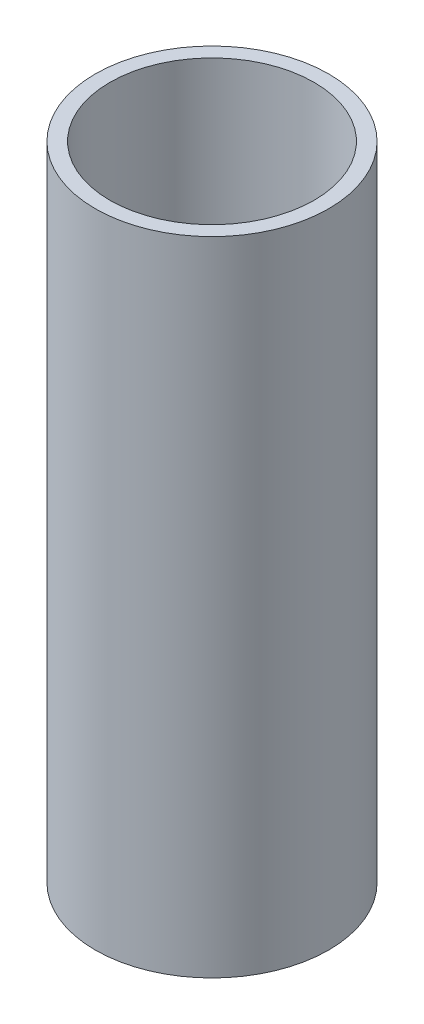
ISO-10303-21;
HEADER;
FILE_DESCRIPTION(('STEP AP214'),'2;1');
FILE_NAME('part.step','',(''),(''),'','','');
FILE_SCHEMA(('AUTOMOTIVE_DESIGN { 1 0 10303 214 1 1 1 1 }'));
ENDSEC;
DATA;
#1=APPLICATION_CONTEXT('core data for automotive mechanical design processes');
#2=APPLICATION_PROTOCOL_DEFINITION('international standard','automotive_design',2000,#1);
#3=PRODUCT_CONTEXT('',#1,'mechanical');
#4=PRODUCT('Part','Part','',(#3));
#5=PRODUCT_RELATED_PRODUCT_CATEGORY('part','',(#4));
#6=PRODUCT_DEFINITION_FORMATION('','',#4);
#7=PRODUCT_DEFINITION_CONTEXT('part definition',#1,'design');
#8=PRODUCT_DEFINITION('design','',#6,#7);
#9=PRODUCT_DEFINITION_SHAPE('','',#8);
#10=(LENGTH_UNIT() NAMED_UNIT(*) SI_UNIT(.MILLI.,.METRE.));
#11=(NAMED_UNIT(*) PLANE_ANGLE_UNIT() SI_UNIT($,.RADIAN.));
#12=(NAMED_UNIT(*) SI_UNIT($,.STERADIAN.) SOLID_ANGLE_UNIT());
#13=UNCERTAINTY_MEASURE_WITH_UNIT(LENGTH_MEASURE(1.E-05),#10,'distance_accuracy_value','');
#14=(GEOMETRIC_REPRESENTATION_CONTEXT(3) GLOBAL_UNCERTAINTY_ASSIGNED_CONTEXT((#13)) GLOBAL_UNIT_ASSIGNED_CONTEXT((#10,
#11,#12)) REPRESENTATION_CONTEXT('',''));
#15=CARTESIAN_POINT('',(0.,0.,0.));
#16=DIRECTION('',(0.,0.,1.));
#17=DIRECTION('',(1.,0.,0.));
#18=AXIS2_PLACEMENT_3D('',#15,#16,#17);
#19=CARTESIAN_POINT('',(0.,33.,0.));
#20=DIRECTION('',(0.,1.,0.));
#21=DIRECTION('',(0.,0.,1.));
#22=AXIS2_PLACEMENT_3D('',#19,#20,#21);
#23=PLANE('',#22);
#24=CARTESIAN_POINT('',(0.,33.,0.));
#25=DIRECTION('',(0.,1.,0.));
#26=DIRECTION('',(0.,0.,1.));
#27=AXIS2_PLACEMENT_3D('',#24,#25,#26);
#28=CIRCLE('',#27,12.);
#29=CARTESIAN_POINT('',(0.,33.,12.));
#30=VERTEX_POINT('',#29);
#31=EDGE_CURVE('E10',#30,#30,#28,.T.);
#32=ORIENTED_EDGE('',*,*,#31,.T.);
#33=EDGE_LOOP('',(#32));
#34=FACE_BOUND('',#33,.T.);
#35=CARTESIAN_POINT('',(0.,33.,0.));
#36=DIRECTION('',(0.,1.,0.));
#37=DIRECTION('',(0.,0.,1.));
#38=AXIS2_PLACEMENT_3D('',#35,#36,#37);
#39=CIRCLE('',#38,10.5);
#40=CARTESIAN_POINT('',(0.,33.,10.5));
#41=VERTEX_POINT('',#40);
#42=EDGE_CURVE('E42',#41,#41,#39,.T.);
#43=ORIENTED_EDGE('',*,*,#42,.F.);
#44=EDGE_LOOP('',(#43));
#45=FACE_BOUND('',#44,.T.);
#46=ADVANCED_FACE('F31',(#34,#45),#23,.T.);
#47=CARTESIAN_POINT('',(0.,-33.,0.));
#48=DIRECTION('',(0.,1.,0.));
#49=DIRECTION('',(0.,0.,1.));
#50=AXIS2_PLACEMENT_3D('',#47,#48,#49);
#51=PLANE('',#50);
#52=CARTESIAN_POINT('',(0.,-33.,0.));
#53=DIRECTION('',(0.,1.,0.));
#54=DIRECTION('',(0.,0.,1.));
#55=AXIS2_PLACEMENT_3D('',#52,#53,#54);
#56=CIRCLE('',#55,12.);
#57=CARTESIAN_POINT('',(0.,-33.,12.));
#58=VERTEX_POINT('',#57);
#59=EDGE_CURVE('E35',#58,#58,#56,.T.);
#60=ORIENTED_EDGE('',*,*,#59,.F.);
#61=EDGE_LOOP('',(#60));
#62=FACE_BOUND('',#61,.T.);
#63=CARTESIAN_POINT('',(0.,-33.,0.));
#64=DIRECTION('',(0.,1.,0.));
#65=DIRECTION('',(0.,0.,1.));
#66=AXIS2_PLACEMENT_3D('',#63,#64,#65);
#67=CIRCLE('',#66,10.5);
#68=CARTESIAN_POINT('',(0.,-33.,10.5));
#69=VERTEX_POINT('',#68);
#70=EDGE_CURVE('E44',#69,#69,#67,.T.);
#71=ORIENTED_EDGE('',*,*,#70,.T.);
#72=EDGE_LOOP('',(#71));
#73=FACE_BOUND('',#72,.T.);
#74=ADVANCED_FACE('F54',(#62,#73),#51,.F.);
#75=CARTESIAN_POINT('',(0.,33.,0.));
#76=DIRECTION('',(0.,-1.,0.));
#77=DIRECTION('',(0.,0.,-1.));
#78=AXIS2_PLACEMENT_3D('',#75,#76,#77);
#79=CYLINDRICAL_SURFACE('',#78,12.);
#80=ORIENTED_EDGE('',*,*,#31,.F.);
#81=EDGE_LOOP('',(#80));
#82=FACE_BOUND('',#81,.T.);
#83=ORIENTED_EDGE('',*,*,#59,.T.);
#84=EDGE_LOOP('',(#83));
#85=FACE_BOUND('',#84,.T.);
#86=ADVANCED_FACE('F33',(#82,#85),#79,.T.);
#87=CARTESIAN_POINT('',(0.,33.,0.));
#88=DIRECTION('',(0.,-1.,0.));
#89=DIRECTION('',(0.,0.,-1.));
#90=AXIS2_PLACEMENT_3D('',#87,#88,#89);
#91=CYLINDRICAL_SURFACE('',#90,10.5);
#92=ORIENTED_EDGE('',*,*,#42,.T.);
#93=EDGE_LOOP('',(#92));
#94=FACE_BOUND('',#93,.T.);
#95=ORIENTED_EDGE('',*,*,#70,.F.);
#96=EDGE_LOOP('',(#95));
#97=FACE_BOUND('',#96,.T.);
#98=ADVANCED_FACE('F50',(#94,#97),#91,.F.);
#99=CLOSED_SHELL('',(#46,#74,#86,#98));
#100=MANIFOLD_SOLID_BREP('B2',#99);
#101=ADVANCED_BREP_SHAPE_REPRESENTATION('',(#18,#100),#14);
#102=SHAPE_DEFINITION_REPRESENTATION(#9,#101);
ENDSEC;
END-ISO-10303-21;
